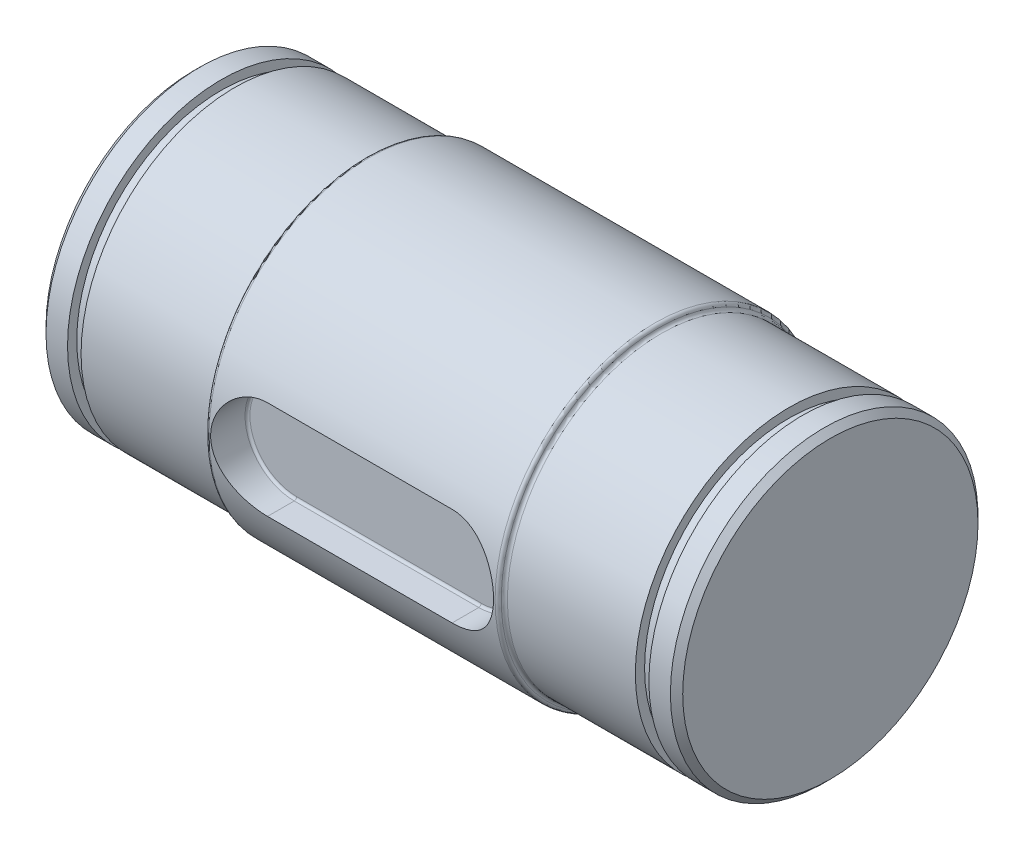
ISO-10303-21;
HEADER;
FILE_DESCRIPTION(('STEP AP214'),'2;1');
FILE_NAME('part.step','',(''),(''),'','','');
FILE_SCHEMA(('AUTOMOTIVE_DESIGN { 1 0 10303 214 1 1 1 1 }'));
ENDSEC;
DATA;
#1=APPLICATION_CONTEXT('core data for automotive mechanical design processes');
#2=APPLICATION_PROTOCOL_DEFINITION('international standard','automotive_design',2000,#1);
#3=PRODUCT_CONTEXT('',#1,'mechanical');
#4=PRODUCT('Part','Part','',(#3));
#5=PRODUCT_RELATED_PRODUCT_CATEGORY('part','',(#4));
#6=PRODUCT_DEFINITION_FORMATION('','',#4);
#7=PRODUCT_DEFINITION_CONTEXT('part definition',#1,'design');
#8=PRODUCT_DEFINITION('design','',#6,#7);
#9=PRODUCT_DEFINITION_SHAPE('','',#8);
#10=(LENGTH_UNIT() NAMED_UNIT(*) SI_UNIT(.MILLI.,.METRE.));
#11=(NAMED_UNIT(*) PLANE_ANGLE_UNIT() SI_UNIT($,.RADIAN.));
#12=(NAMED_UNIT(*) SI_UNIT($,.STERADIAN.) SOLID_ANGLE_UNIT());
#13=UNCERTAINTY_MEASURE_WITH_UNIT(LENGTH_MEASURE(1.E-05),#10,'distance_accuracy_value','');
#14=(GEOMETRIC_REPRESENTATION_CONTEXT(3) GLOBAL_UNCERTAINTY_ASSIGNED_CONTEXT((#13)) GLOBAL_UNIT_ASSIGNED_CONTEXT((#10,
#11,#12)) REPRESENTATION_CONTEXT('',''));
#15=CARTESIAN_POINT('',(0.,0.,0.));
#16=DIRECTION('',(0.,0.,1.));
#17=DIRECTION('',(1.,0.,0.));
#18=AXIS2_PLACEMENT_3D('',#15,#16,#17);
#19=CARTESIAN_POINT('',(51.75,0.,0.));
#20=DIRECTION('',(-1.,0.,0.));
#21=DIRECTION('',(0.,0.,1.));
#22=AXIS2_PLACEMENT_3D('',#19,#20,#21);
#23=PLANE('',#22);
#24=CARTESIAN_POINT('',(51.75,0.,0.));
#25=DIRECTION('',(-1.,0.,0.));
#26=DIRECTION('',(0.,0.,1.));
#27=AXIS2_PLACEMENT_3D('',#24,#25,#26);
#28=CIRCLE('',#27,24.000008612981);
#29=CARTESIAN_POINT('',(51.75,0.,24.000008612981));
#30=VERTEX_POINT('',#29);
#31=EDGE_CURVE('E20',#30,#30,#28,.T.);
#32=ORIENTED_EDGE('',*,*,#31,.F.);
#33=EDGE_LOOP('',(#32));
#34=FACE_BOUND('',#33,.T.);
#35=ADVANCED_FACE('F17',(#34),#23,.F.);
#36=CARTESIAN_POINT('',(-51.75,0.,0.));
#37=DIRECTION('',(-1.,0.,0.));
#38=DIRECTION('',(0.,0.,1.));
#39=AXIS2_PLACEMENT_3D('',#36,#37,#38);
#40=PLANE('',#39);
#41=CARTESIAN_POINT('',(-51.75,0.,1.20553902987361E-13));
#42=DIRECTION('',(-1.,0.,0.));
#43=DIRECTION('',(0.,0.,1.));
#44=AXIS2_PLACEMENT_3D('',#41,#42,#43);
#45=CIRCLE('',#44,24.0000096194053);
#46=CARTESIAN_POINT('',(-51.75,0.,24.0000096194054));
#47=VERTEX_POINT('',#46);
#48=EDGE_CURVE('E185',#47,#47,#45,.F.);
#49=ORIENTED_EDGE('',*,*,#48,.F.);
#50=EDGE_LOOP('',(#49));
#51=FACE_BOUND('',#50,.T.);
#52=ADVANCED_FACE('F422',(#51),#40,.T.);
#53=CARTESIAN_POINT('',(50.7500044859261,0.,0.));
#54=DIRECTION('',(-1.,0.,0.));
#55=DIRECTION('',(0.,0.,1.));
#56=AXIS2_PLACEMENT_3D('',#53,#54,#55);
#57=CONICAL_SURFACE('',#56,25.0000044859245,0.785398342833002);
#58=ORIENTED_EDGE('',*,*,#31,.T.);
#59=EDGE_LOOP('',(#58));
#60=FACE_BOUND('',#59,.T.);
#61=CARTESIAN_POINT('',(50.7500044865,0.,0.));
#62=DIRECTION('',(-1.,0.,0.));
#63=DIRECTION('',(0.,0.,1.));
#64=AXIS2_PLACEMENT_3D('',#61,#62,#63);
#65=CIRCLE('',#64,25.);
#66=CARTESIAN_POINT('',(50.7500044865,0.,25.));
#67=VERTEX_POINT('',#66);
#68=EDGE_CURVE('E181',#67,#67,#65,.T.);
#69=ORIENTED_EDGE('',*,*,#68,.F.);
#70=EDGE_LOOP('',(#69));
#71=FACE_BOUND('',#70,.T.);
#72=ADVANCED_FACE('F414',(#60,#71),#57,.T.);
#73=CARTESIAN_POINT('',(-50.7500050101063,0.,1.20301066671185E-13));
#74=DIRECTION('',(1.,0.,0.));
#75=DIRECTION('',(0.,0.,-1.));
#76=AXIS2_PLACEMENT_3D('',#73,#74,#75);
#77=CONICAL_SURFACE('',#76,25.0000050101042,0.785398363801);
#78=CARTESIAN_POINT('',(-50.7500100202085,0.,1.20301065975894E-13));
#79=DIRECTION('',(1.,0.,0.));
#80=DIRECTION('',(0.,0.,-1.));
#81=AXIS2_PLACEMENT_3D('',#78,#79,#80);
#82=CIRCLE('',#81,25.);
#83=CARTESIAN_POINT('',(-50.7500100202085,0.,-24.9999999999999));
#84=VERTEX_POINT('',#83);
#85=EDGE_CURVE('E184',#84,#84,#82,.T.);
#86=ORIENTED_EDGE('',*,*,#85,.F.);
#87=EDGE_LOOP('',(#86));
#88=FACE_BOUND('',#87,.T.);
#89=ORIENTED_EDGE('',*,*,#48,.T.);
#90=EDGE_LOOP('',(#89));
#91=FACE_BOUND('',#90,.T.);
#92=ADVANCED_FACE('F406',(#88,#91),#77,.T.);
#93=CARTESIAN_POINT('',(56.925,0.,0.));
#94=DIRECTION('',(-1.,0.,0.));
#95=DIRECTION('',(0.,0.,1.));
#96=AXIS2_PLACEMENT_3D('',#93,#94,#95);
#97=CYLINDRICAL_SURFACE('',#96,25.);
#98=CARTESIAN_POINT('',(47.25,0.,0.));
#99=DIRECTION('',(-1.,0.,0.));
#100=DIRECTION('',(0.,0.,1.));
#101=AXIS2_PLACEMENT_3D('',#98,#99,#100);
#102=CIRCLE('',#101,25.);
#103=CARTESIAN_POINT('',(47.25,0.,25.));
#104=VERTEX_POINT('',#103);
#105=EDGE_CURVE('E519',#104,#104,#102,.T.);
#106=ORIENTED_EDGE('',*,*,#105,.F.);
#107=EDGE_LOOP('',(#106));
#108=FACE_BOUND('',#107,.T.);
#109=ORIENTED_EDGE('',*,*,#68,.T.);
#110=EDGE_LOOP('',(#109));
#111=FACE_BOUND('',#110,.T.);
#112=ADVANCED_FACE('F398',(#108,#111),#97,.T.);
#113=CARTESIAN_POINT('',(56.925,0.,0.));
#114=DIRECTION('',(-1.,0.,0.));
#115=DIRECTION('',(0.,0.,1.));
#116=AXIS2_PLACEMENT_3D('',#113,#114,#115);
#117=CYLINDRICAL_SURFACE('',#116,25.);
#118=CARTESIAN_POINT('',(-47.25,0.,0.));
#119=DIRECTION('',(-1.,0.,0.));
#120=DIRECTION('',(0.,0.,1.));
#121=AXIS2_PLACEMENT_3D('',#118,#119,#120);
#122=CIRCLE('',#121,25.);
#123=CARTESIAN_POINT('',(-47.25,0.,25.));
#124=VERTEX_POINT('',#123);
#125=EDGE_CURVE('E522',#124,#124,#122,.T.);
#126=ORIENTED_EDGE('',*,*,#125,.T.);
#127=EDGE_LOOP('',(#126));
#128=FACE_BOUND('',#127,.T.);
#129=ORIENTED_EDGE('',*,*,#85,.T.);
#130=EDGE_LOOP('',(#129));
#131=FACE_BOUND('',#130,.T.);
#132=ADVANCED_FACE('F390',(#128,#131),#117,.T.);
#133=CARTESIAN_POINT('',(47.25,0.,0.));
#134=DIRECTION('',(-1.,0.,0.));
#135=DIRECTION('',(0.,0.,1.));
#136=AXIS2_PLACEMENT_3D('',#133,#134,#135);
#137=PLANE('',#136);
#138=CARTESIAN_POINT('',(47.25,0.,0.));
#139=DIRECTION('',(-1.,0.,0.));
#140=DIRECTION('',(0.,0.,1.));
#141=AXIS2_PLACEMENT_3D('',#138,#139,#140);
#142=CIRCLE('',#141,23.5);
#143=CARTESIAN_POINT('',(47.25,0.,23.5));
#144=VERTEX_POINT('',#143);
#145=EDGE_CURVE('E525',#144,#144,#142,.T.);
#146=ORIENTED_EDGE('',*,*,#145,.F.);
#147=EDGE_LOOP('',(#146));
#148=FACE_BOUND('',#147,.T.);
#149=ORIENTED_EDGE('',*,*,#105,.T.);
#150=EDGE_LOOP('',(#149));
#151=FACE_BOUND('',#150,.T.);
#152=ADVANCED_FACE('F382',(#148,#151),#137,.T.);
#153=CARTESIAN_POINT('',(-47.25,0.,0.));
#154=DIRECTION('',(-1.,0.,0.));
#155=DIRECTION('',(0.,0.,1.));
#156=AXIS2_PLACEMENT_3D('',#153,#154,#155);
#157=PLANE('',#156);
#158=CARTESIAN_POINT('',(-47.25,0.,0.));
#159=DIRECTION('',(-1.,0.,0.));
#160=DIRECTION('',(0.,0.,1.));
#161=AXIS2_PLACEMENT_3D('',#158,#159,#160);
#162=CIRCLE('',#161,23.5);
#163=CARTESIAN_POINT('',(-47.25,0.,23.5));
#164=VERTEX_POINT('',#163);
#165=EDGE_CURVE('E528',#164,#164,#162,.F.);
#166=ORIENTED_EDGE('',*,*,#165,.F.);
#167=EDGE_LOOP('',(#166));
#168=FACE_BOUND('',#167,.T.);
#169=ORIENTED_EDGE('',*,*,#125,.F.);
#170=EDGE_LOOP('',(#169));
#171=FACE_BOUND('',#170,.T.);
#172=ADVANCED_FACE('F374',(#168,#171),#157,.F.);
#173=CARTESIAN_POINT('',(56.925,0.,0.));
#174=DIRECTION('',(-1.,0.,0.));
#175=DIRECTION('',(0.,0.,1.));
#176=AXIS2_PLACEMENT_3D('',#173,#174,#175);
#177=CYLINDRICAL_SURFACE('',#176,23.5);
#178=CARTESIAN_POINT('',(45.05,0.,0.));
#179=DIRECTION('',(-1.,0.,0.));
#180=DIRECTION('',(0.,0.,1.));
#181=AXIS2_PLACEMENT_3D('',#178,#179,#180);
#182=CIRCLE('',#181,23.5);
#183=CARTESIAN_POINT('',(45.05,0.,23.5));
#184=VERTEX_POINT('',#183);
#185=EDGE_CURVE('E531',#184,#184,#182,.F.);
#186=ORIENTED_EDGE('',*,*,#185,.T.);
#187=EDGE_LOOP('',(#186));
#188=FACE_BOUND('',#187,.T.);
#189=ORIENTED_EDGE('',*,*,#145,.T.);
#190=EDGE_LOOP('',(#189));
#191=FACE_BOUND('',#190,.T.);
#192=ADVANCED_FACE('F366',(#188,#191),#177,.T.);
#193=CARTESIAN_POINT('',(56.925,0.,0.));
#194=DIRECTION('',(-1.,0.,0.));
#195=DIRECTION('',(0.,0.,1.));
#196=AXIS2_PLACEMENT_3D('',#193,#194,#195);
#197=CYLINDRICAL_SURFACE('',#196,23.5);
#198=ORIENTED_EDGE('',*,*,#165,.T.);
#199=EDGE_LOOP('',(#198));
#200=FACE_BOUND('',#199,.T.);
#201=CARTESIAN_POINT('',(-45.05,0.,0.));
#202=DIRECTION('',(-1.,0.,0.));
#203=DIRECTION('',(0.,0.,1.));
#204=AXIS2_PLACEMENT_3D('',#201,#202,#203);
#205=CIRCLE('',#204,23.5);
#206=CARTESIAN_POINT('',(-45.05,0.,23.5));
#207=VERTEX_POINT('',#206);
#208=EDGE_CURVE('E534',#207,#207,#205,.F.);
#209=ORIENTED_EDGE('',*,*,#208,.F.);
#210=EDGE_LOOP('',(#209));
#211=FACE_BOUND('',#210,.T.);
#212=ADVANCED_FACE('F358',(#200,#211),#197,.T.);
#213=CARTESIAN_POINT('',(45.05,0.,0.));
#214=DIRECTION('',(-1.,0.,0.));
#215=DIRECTION('',(0.,0.,1.));
#216=AXIS2_PLACEMENT_3D('',#213,#214,#215);
#217=PLANE('',#216);
#218=ORIENTED_EDGE('',*,*,#185,.F.);
#219=EDGE_LOOP('',(#218));
#220=FACE_BOUND('',#219,.T.);
#221=CARTESIAN_POINT('',(45.05,0.,0.));
#222=DIRECTION('',(-1.,0.,0.));
#223=DIRECTION('',(0.,0.,1.));
#224=AXIS2_PLACEMENT_3D('',#221,#222,#223);
#225=CIRCLE('',#224,25.);
#226=CARTESIAN_POINT('',(45.05,0.,25.));
#227=VERTEX_POINT('',#226);
#228=EDGE_CURVE('E89',#227,#227,#225,.T.);
#229=ORIENTED_EDGE('',*,*,#228,.F.);
#230=EDGE_LOOP('',(#229));
#231=FACE_BOUND('',#230,.T.);
#232=ADVANCED_FACE('F350',(#220,#231),#217,.F.);
#233=CARTESIAN_POINT('',(-45.05,0.,0.));
#234=DIRECTION('',(-1.,0.,0.));
#235=DIRECTION('',(0.,0.,1.));
#236=AXIS2_PLACEMENT_3D('',#233,#234,#235);
#237=PLANE('',#236);
#238=ORIENTED_EDGE('',*,*,#208,.T.);
#239=EDGE_LOOP('',(#238));
#240=FACE_BOUND('',#239,.T.);
#241=CARTESIAN_POINT('',(-45.05,0.,0.));
#242=DIRECTION('',(-1.,0.,0.));
#243=DIRECTION('',(0.,0.,1.));
#244=AXIS2_PLACEMENT_3D('',#241,#242,#243);
#245=CIRCLE('',#244,25.);
#246=CARTESIAN_POINT('',(-45.05,0.,25.));
#247=VERTEX_POINT('',#246);
#248=EDGE_CURVE('E88',#247,#247,#245,.F.);
#249=ORIENTED_EDGE('',*,*,#248,.F.);
#250=EDGE_LOOP('',(#249));
#251=FACE_BOUND('',#250,.T.);
#252=ADVANCED_FACE('F342',(#240,#251),#237,.T.);
#253=CARTESIAN_POINT('',(56.925,0.,0.));
#254=DIRECTION('',(-1.,0.,0.));
#255=DIRECTION('',(0.,0.,1.));
#256=AXIS2_PLACEMENT_3D('',#253,#254,#255);
#257=CYLINDRICAL_SURFACE('',#256,25.);
#258=ORIENTED_EDGE('',*,*,#228,.T.);
#259=EDGE_LOOP('',(#258));
#260=FACE_BOUND('',#259,.T.);
#261=CARTESIAN_POINT('',(24.25,0.,0.));
#262=DIRECTION('',(-1.,0.,0.));
#263=DIRECTION('',(0.,1.,-5.23143334208E-12));
#264=AXIS2_PLACEMENT_3D('',#261,#262,#263);
#265=CIRCLE('',#264,25.);
#266=CARTESIAN_POINT('',(24.25,25.,-1.30776526629399E-10));
#267=VERTEX_POINT('',#266);
#268=EDGE_CURVE('E178',#267,#267,#265,.F.);
#269=ORIENTED_EDGE('',*,*,#268,.T.);
#270=EDGE_LOOP('',(#269));
#271=FACE_BOUND('',#270,.T.);
#272=ADVANCED_FACE('F336',(#260,#271),#257,.T.);
#273=CARTESIAN_POINT('',(0.,0.,20.));
#274=DIRECTION('',(0.,0.,1.));
#275=DIRECTION('',(1.,0.,0.));
#276=AXIS2_PLACEMENT_3D('',#273,#274,#275);
#277=PLANE('',#276);
#278=DIRECTION('',(1.,0.,0.));
#279=VECTOR('',#278,1.);
#280=CARTESIAN_POINT('',(-15.2773739955,7.6,20.));
#281=LINE('',#280,#279);
#282=CARTESIAN_POINT('',(15.,7.6,20.));
#283=VERTEX_POINT('',#282);
#284=CARTESIAN_POINT('',(-15.,7.6,20.));
#285=VERTEX_POINT('',#284);
#286=EDGE_CURVE('E77',#283,#285,#281,.F.);
#287=ORIENTED_EDGE('',*,*,#286,.T.);
#288=CARTESIAN_POINT('',(-15.,0.,20.));
#289=DIRECTION('',(0.,0.,-1.));
#290=DIRECTION('',(0.,-1.,0.));
#291=AXIS2_PLACEMENT_3D('',#288,#289,#290);
#292=CIRCLE('',#291,7.6);
#293=CARTESIAN_POINT('',(-15.,-7.6,20.));
#294=VERTEX_POINT('',#293);
#295=EDGE_CURVE('E81',#285,#294,#292,.F.);
#296=ORIENTED_EDGE('',*,*,#295,.T.);
#297=DIRECTION('',(-1.,0.,0.));
#298=VECTOR('',#297,1.);
#299=CARTESIAN_POINT('',(15.2773739955,-7.6,20.));
#300=LINE('',#299,#298);
#301=CARTESIAN_POINT('',(15.,-7.6,20.));
#302=VERTEX_POINT('',#301);
#303=EDGE_CURVE('E144',#294,#302,#300,.F.);
#304=ORIENTED_EDGE('',*,*,#303,.T.);
#305=CARTESIAN_POINT('',(15.,0.,20.));
#306=DIRECTION('',(0.,0.,-1.));
#307=DIRECTION('',(0.,1.,0.));
#308=AXIS2_PLACEMENT_3D('',#305,#306,#307);
#309=CIRCLE('',#308,7.6);
#310=EDGE_CURVE('E84',#302,#283,#309,.F.);
#311=ORIENTED_EDGE('',*,*,#310,.T.);
#312=EDGE_LOOP('',(#287,#296,#304,#311));
#313=FACE_BOUND('',#312,.T.);
#314=ADVANCED_FACE('F79',(#313),#277,.T.);
#315=CARTESIAN_POINT('',(-15.2773739955,7.6,20.4));
#316=DIRECTION('',(1.,0.,0.));
#317=DIRECTION('',(0.,0.,-1.));
#318=AXIS2_PLACEMENT_3D('',#315,#316,#317);
#319=CYLINDRICAL_SURFACE('',#318,0.4);
#320=DIRECTION('',(1.,0.,0.));
#321=VECTOR('',#320,1.);
#322=CARTESIAN_POINT('',(15.,8.,20.4));
#323=LINE('',#322,#321);
#324=CARTESIAN_POINT('',(15.,8.,20.4));
#325=VERTEX_POINT('',#324);
#326=CARTESIAN_POINT('',(-15.,8.,20.4));
#327=VERTEX_POINT('',#326);
#328=EDGE_CURVE('E95',#325,#327,#323,.F.);
#329=ORIENTED_EDGE('',*,*,#328,.T.);
#330=CARTESIAN_POINT('',(-15.,7.6,20.4));
#331=DIRECTION('',(-1.,0.,0.));
#332=DIRECTION('',(0.,1.,0.));
#333=AXIS2_PLACEMENT_3D('',#330,#331,#332);
#334=CIRCLE('',#333,0.4);
#335=EDGE_CURVE('E92',#327,#285,#334,.T.);
#336=ORIENTED_EDGE('',*,*,#335,.T.);
#337=ORIENTED_EDGE('',*,*,#286,.F.);
#338=CARTESIAN_POINT('',(15.,7.6,20.4));
#339=DIRECTION('',(-1.,0.,0.));
#340=DIRECTION('',(0.,1.,0.));
#341=AXIS2_PLACEMENT_3D('',#338,#339,#340);
#342=CIRCLE('',#341,0.4);
#343=EDGE_CURVE('E149',#283,#325,#342,.F.);
#344=ORIENTED_EDGE('',*,*,#343,.T.);
#345=EDGE_LOOP('',(#329,#336,#337,#344));
#346=FACE_BOUND('',#345,.T.);
#347=ADVANCED_FACE('F93',(#346),#319,.F.);
#348=CARTESIAN_POINT('',(56.925,0.,0.));
#349=DIRECTION('',(-1.,0.,0.));
#350=DIRECTION('',(0.,0.,1.));
#351=AXIS2_PLACEMENT_3D('',#348,#349,#350);
#352=CYLINDRICAL_SURFACE('',#351,25.);
#353=ORIENTED_EDGE('',*,*,#248,.T.);
#354=EDGE_LOOP('',(#353));
#355=FACE_BOUND('',#354,.T.);
#356=CARTESIAN_POINT('',(-24.25,0.,0.));
#357=DIRECTION('',(-1.,0.,0.));
#358=DIRECTION('',(0.,1.,9.13429921978E-13));
#359=AXIS2_PLACEMENT_3D('',#356,#357,#358);
#360=CIRCLE('',#359,25.);
#361=CARTESIAN_POINT('',(-24.25,25.,2.28391156312348E-11));
#362=VERTEX_POINT('',#361);
#363=EDGE_CURVE('E175',#362,#362,#360,.T.);
#364=ORIENTED_EDGE('',*,*,#363,.T.);
#365=EDGE_LOOP('',(#364));
#366=FACE_BOUND('',#365,.T.);
#367=ADVANCED_FACE('F317',(#355,#366),#352,.T.);
#368=CARTESIAN_POINT('',(24.25,0.,0.));
#369=DIRECTION('',(-1.,0.,0.));
#370=DIRECTION('',(0.,1.,-5.23143334208E-12));
#371=AXIS2_PLACEMENT_3D('',#368,#369,#370);
#372=TOROIDAL_SURFACE('',#371,25.5,0.5);
#373=ORIENTED_EDGE('',*,*,#268,.F.);
#374=EDGE_LOOP('',(#373));
#375=FACE_BOUND('',#374,.T.);
#376=CARTESIAN_POINT('',(23.75,0.,0.));
#377=DIRECTION('',(-1.,0.,0.));
#378=DIRECTION('',(0.,1.,-1.54597272484E-11));
#379=AXIS2_PLACEMENT_3D('',#376,#377,#378);
#380=CIRCLE('',#379,25.5);
#381=CARTESIAN_POINT('',(23.75,25.5,-3.94213799141917E-10));
#382=VERTEX_POINT('',#381);
#383=EDGE_CURVE('E140',#382,#382,#380,.T.);
#384=ORIENTED_EDGE('',*,*,#383,.F.);
#385=EDGE_LOOP('',(#384));
#386=FACE_BOUND('',#385,.T.);
#387=ADVANCED_FACE('F155',(#375,#386),#372,.F.);
#388=CARTESIAN_POINT('',(15.,0.,20.4));
#389=DIRECTION('',(0.,0.,1.));
#390=DIRECTION('',(-1.,-1.01712284428E-10,0.));
#391=AXIS2_PLACEMENT_3D('',#388,#389,#390);
#392=TOROIDAL_SURFACE('',#391,7.6,0.4);
#393=CARTESIAN_POINT('',(15.,0.,20.4));
#394=DIRECTION('',(0.,0.,1.));
#395=DIRECTION('',(1.,0.,0.));
#396=AXIS2_PLACEMENT_3D('',#393,#394,#395);
#397=CIRCLE('',#396,8.);
#398=CARTESIAN_POINT('',(15.,-8.,20.4));
#399=VERTEX_POINT('',#398);
#400=EDGE_CURVE('E136',#399,#325,#397,.T.);
#401=ORIENTED_EDGE('',*,*,#400,.T.);
#402=ORIENTED_EDGE('',*,*,#343,.F.);
#403=ORIENTED_EDGE('',*,*,#310,.F.);
#404=CARTESIAN_POINT('',(15.,-7.6,20.4));
#405=DIRECTION('',(-1.,0.,0.));
#406=DIRECTION('',(0.,0.,1.));
#407=AXIS2_PLACEMENT_3D('',#404,#405,#406);
#408=CIRCLE('',#407,0.4);
#409=EDGE_CURVE('E101',#302,#399,#408,.T.);
#410=ORIENTED_EDGE('',*,*,#409,.T.);
#411=EDGE_LOOP('',(#401,#402,#403,#410));
#412=FACE_BOUND('',#411,.T.);
#413=ADVANCED_FACE('F151',(#412),#392,.F.);
#414=CARTESIAN_POINT('',(15.2773739955,-7.6,20.4));
#415=DIRECTION('',(-1.,0.,0.));
#416=DIRECTION('',(0.,0.,1.));
#417=AXIS2_PLACEMENT_3D('',#414,#415,#416);
#418=CYLINDRICAL_SURFACE('',#417,0.4);
#419=DIRECTION('',(1.,0.,0.));
#420=VECTOR('',#419,1.);
#421=CARTESIAN_POINT('',(-15.,-8.,20.4));
#422=LINE('',#421,#420);
#423=CARTESIAN_POINT('',(-15.,-8.,20.4));
#424=VERTEX_POINT('',#423);
#425=EDGE_CURVE('E225',#424,#399,#422,.T.);
#426=ORIENTED_EDGE('',*,*,#425,.T.);
#427=ORIENTED_EDGE('',*,*,#409,.F.);
#428=ORIENTED_EDGE('',*,*,#303,.F.);
#429=CARTESIAN_POINT('',(-15.,-7.6,20.4));
#430=DIRECTION('',(1.,0.,0.));
#431=DIRECTION('',(0.,-1.,0.));
#432=AXIS2_PLACEMENT_3D('',#429,#430,#431);
#433=CIRCLE('',#432,0.4);
#434=EDGE_CURVE('E56',#294,#424,#433,.F.);
#435=ORIENTED_EDGE('',*,*,#434,.T.);
#436=EDGE_LOOP('',(#426,#427,#428,#435));
#437=FACE_BOUND('',#436,.T.);
#438=ADVANCED_FACE('F123',(#437),#418,.F.);
#439=CARTESIAN_POINT('',(-15.,0.,20.4));
#440=DIRECTION('',(0.,0.,1.));
#441=DIRECTION('',(1.,1.01712520351E-10,0.));
#442=AXIS2_PLACEMENT_3D('',#439,#440,#441);
#443=TOROIDAL_SURFACE('',#442,7.6,0.4);
#444=CARTESIAN_POINT('',(-15.,0.,20.4));
#445=DIRECTION('',(0.,0.,1.));
#446=DIRECTION('',(1.,0.,0.));
#447=AXIS2_PLACEMENT_3D('',#444,#445,#446);
#448=CIRCLE('',#447,8.);
#449=EDGE_CURVE('E220',#327,#424,#448,.T.);
#450=ORIENTED_EDGE('',*,*,#449,.T.);
#451=ORIENTED_EDGE('',*,*,#434,.F.);
#452=ORIENTED_EDGE('',*,*,#295,.F.);
#453=ORIENTED_EDGE('',*,*,#335,.F.);
#454=EDGE_LOOP('',(#450,#451,#452,#453));
#455=FACE_BOUND('',#454,.T.);
#456=ADVANCED_FACE('F100',(#455),#443,.F.);
#457=CARTESIAN_POINT('',(15.,8.,26.));
#458=DIRECTION('',(0.,1.,0.));
#459=DIRECTION('',(0.,0.,1.));
#460=AXIS2_PLACEMENT_3D('',#457,#458,#459);
#461=PLANE('',#460);
#462=DIRECTION('',(-1.,0.,0.));
#463=VECTOR('',#462,1.);
#464=CARTESIAN_POINT('',(56.925,8.00000000000175,24.7386337537054));
#465=LINE('',#464,#463);
#466=CARTESIAN_POINT('',(-15.,8.00000000000087,24.7386337537057));
#467=VERTEX_POINT('',#466);
#468=CARTESIAN_POINT('',(15.,8.00000000000087,24.7386337537057));
#469=VERTEX_POINT('',#468);
#470=EDGE_CURVE('E174',#467,#469,#465,.F.);
#471=ORIENTED_EDGE('',*,*,#470,.F.);
#472=DIRECTION('',(0.,0.,1.));
#473=VECTOR('',#472,1.);
#474=CARTESIAN_POINT('',(-15.,8.,26.));
#475=LINE('',#474,#473);
#476=EDGE_CURVE('E171',#467,#327,#475,.F.);
#477=ORIENTED_EDGE('',*,*,#476,.T.);
#478=ORIENTED_EDGE('',*,*,#328,.F.);
#479=DIRECTION('',(0.,0.,1.));
#480=VECTOR('',#479,1.);
#481=CARTESIAN_POINT('',(15.,8.,26.));
#482=LINE('',#481,#480);
#483=EDGE_CURVE('E139',#325,#469,#482,.T.);
#484=ORIENTED_EDGE('',*,*,#483,.T.);
#485=EDGE_LOOP('',(#471,#477,#478,#484));
#486=FACE_BOUND('',#485,.T.);
#487=ADVANCED_FACE('F122',(#486),#461,.F.);
#488=CARTESIAN_POINT('',(-24.25,0.,0.));
#489=DIRECTION('',(-1.,0.,0.));
#490=DIRECTION('',(0.,1.,9.13429921978E-13));
#491=AXIS2_PLACEMENT_3D('',#488,#489,#490);
#492=TOROIDAL_SURFACE('',#491,25.5,0.5);
#493=ORIENTED_EDGE('',*,*,#363,.F.);
#494=EDGE_LOOP('',(#493));
#495=FACE_BOUND('',#494,.T.);
#496=CARTESIAN_POINT('',(-23.75,0.,0.));
#497=DIRECTION('',(-1.,0.,0.));
#498=DIRECTION('',(0.,1.,-1.28839057478E-11));
#499=AXIS2_PLACEMENT_3D('',#496,#497,#498);
#500=CIRCLE('',#499,25.5);
#501=CARTESIAN_POINT('',(-23.75,25.5,-3.28536167756797E-10));
#502=VERTEX_POINT('',#501);
#503=EDGE_CURVE('E162',#502,#502,#500,.F.);
#504=ORIENTED_EDGE('',*,*,#503,.F.);
#505=EDGE_LOOP('',(#504));
#506=FACE_BOUND('',#505,.T.);
#507=ADVANCED_FACE('F238',(#495,#506),#492,.F.);
#508=CARTESIAN_POINT('',(23.25,0.,0.));
#509=DIRECTION('',(-1.,0.,0.));
#510=DIRECTION('',(0.,1.,-1.54597272484E-11));
#511=AXIS2_PLACEMENT_3D('',#508,#509,#510);
#512=TOROIDAL_SURFACE('',#511,25.5,0.5);
#513=ORIENTED_EDGE('',*,*,#383,.T.);
#514=EDGE_LOOP('',(#513));
#515=FACE_BOUND('',#514,.T.);
#516=CARTESIAN_POINT('',(23.25,0.,0.));
#517=DIRECTION('',(-1.,0.,0.));
#518=DIRECTION('',(0.,0.,1.));
#519=AXIS2_PLACEMENT_3D('',#516,#517,#518);
#520=CIRCLE('',#519,26.);
#521=CARTESIAN_POINT('',(23.25,0.,26.));
#522=VERTEX_POINT('',#521);
#523=EDGE_CURVE('E170',#522,#522,#520,.T.);
#524=ORIENTED_EDGE('',*,*,#523,.F.);
#525=EDGE_LOOP('',(#524));
#526=FACE_BOUND('',#525,.T.);
#527=ADVANCED_FACE('F235',(#515,#526),#512,.T.);
#528=CARTESIAN_POINT('',(15.,0.,26.));
#529=DIRECTION('',(0.,0.,1.));
#530=DIRECTION('',(1.,0.,0.));
#531=AXIS2_PLACEMENT_3D('',#528,#529,#530);
#532=CYLINDRICAL_SURFACE('',#531,8.);
#533=CARTESIAN_POINT('',(15.,8.,24.738633753706));
#534=CARTESIAN_POINT('',(15.2192705588559,8.00003002803162,24.7386012686902));
#535=CARTESIAN_POINT('',(15.4385292011944,7.99098645035781,24.7415479133923));
#536=CARTESIAN_POINT('',(15.8753670754415,7.9549746883724,24.7531621395127));
#537=CARTESIAN_POINT('',(16.0929466893541,7.92801071060019,24.7618283783405));
#538=CARTESIAN_POINT('',(16.5243086661961,7.85647453724807,24.7846147424266));
#539=CARTESIAN_POINT('',(16.7380994947822,7.81194872986761,24.7987204974571));
#540=CARTESIAN_POINT('',(17.1609660171612,7.7056956832938,24.8319425235332));
#541=CARTESIAN_POINT('',(17.3700415773019,7.64396795717979,24.8510589364105));
#542=CARTESIAN_POINT('',(17.7819259738527,7.50387777626658,24.8937173687698));
#543=CARTESIAN_POINT('',(17.9847386151953,7.42552565853958,24.9172566370773));
#544=CARTESIAN_POINT('',(18.3829970861467,7.25275564566746,24.9680924942892));
#545=CARTESIAN_POINT('',(18.5784401491538,7.15833178898069,24.995390476705));
#546=CARTESIAN_POINT('',(18.9607145898912,6.9541146971394,25.0529746731592));
#547=CARTESIAN_POINT('',(19.1475440728055,6.8443181015302,25.0832615401342));
#548=CARTESIAN_POINT('',(19.5114410126458,6.61012270031495,25.1459931100598));
#549=CARTESIAN_POINT('',(19.6885079266419,6.48572308378625,25.1784379328007));
#550=CARTESIAN_POINT('',(20.0369763655414,6.21919710421829,25.2456140569195));
#551=CARTESIAN_POINT('',(20.2080500182667,6.07665181367262,25.2803847217888));
#552=CARTESIAN_POINT('',(20.5376821024352,5.77785117844753,25.3503446706514));
#553=CARTESIAN_POINT('',(20.6962403247892,5.62159560480917,25.3855339616272));
#554=CARTESIAN_POINT('',(20.9998998793105,5.2962935836556,25.4553914397402));
#555=CARTESIAN_POINT('',(21.1449962502721,5.12724246184191,25.4900594308455));
#556=CARTESIAN_POINT('',(21.4207127076744,4.77745129335323,25.5579282045035));
#557=CARTESIAN_POINT('',(21.5513332056527,4.59671157920696,25.5911290287506));
#558=CARTESIAN_POINT('',(21.7999754970546,4.22046376048394,25.6558946570076));
#559=CARTESIAN_POINT('',(21.9176469613182,4.0247146042073,25.6874057186764));
#560=CARTESIAN_POINT('',(22.1359668706181,3.62354913789891,25.7470580360845));
#561=CARTESIAN_POINT('',(22.2366218442432,3.41813657419523,25.7752005829809));
#562=CARTESIAN_POINT('',(22.420055917156,2.99916792684629,25.8273013235358));
#563=CARTESIAN_POINT('',(22.5028503862171,2.78561903261708,25.8512631115037));
#564=CARTESIAN_POINT('',(22.649921354537,2.3518422630008,25.8943308209309));
#565=CARTESIAN_POINT('',(22.7142024835504,2.13161607270256,25.9134379562845));
#566=CARTESIAN_POINT('',(22.8454431758837,1.59741783786105,25.9527560719791));
#567=CARTESIAN_POINT('',(22.903314691152,1.28097205456156,25.9703879749263));
#568=CARTESIAN_POINT('',(22.9805892392786,0.642981149249854,25.9940075673692));
#569=CARTESIAN_POINT('',(22.9999938147905,0.321436232251335,25.999995723818));
#570=CARTESIAN_POINT('',(23.0000042165041,-0.219125510161256,26.0000029151056));
#571=CARTESIAN_POINT('',(22.990993512199,-0.438200511781659,25.9972249702586));
#572=CARTESIAN_POINT('',(22.9550411980609,-0.874802538634958,25.9861956845295));
#573=CARTESIAN_POINT('',(22.9280961769278,-1.09232926141121,25.9779433023514));
#574=CARTESIAN_POINT('',(22.8564928823853,-1.52429991765145,25.9561808535043));
#575=CARTESIAN_POINT('',(22.811824355255,-1.7387419919777,25.9426677433899));
#576=CARTESIAN_POINT('',(22.7051519279833,-2.16298160545598,25.9107463484076));
#577=CARTESIAN_POINT('',(22.6431414905465,-2.37277736085953,25.8923362176617));
#578=CARTESIAN_POINT('',(22.5024729356723,-2.78574605855141,25.8511622754655));
#579=CARTESIAN_POINT('',(22.4238516794593,-2.98893253412193,25.8284081144958));
#580=CARTESIAN_POINT('',(22.2504752944563,-3.38791056183328,25.7791094787746));
#581=CARTESIAN_POINT('',(22.1557141091464,-3.58369930414724,25.7525635817769));
#582=CARTESIAN_POINT('',(21.9508294897242,-3.96649458076771,25.696387547573));
#583=CARTESIAN_POINT('',(21.840712293684,-4.15350464021115,25.6667586640028));
#584=CARTESIAN_POINT('',(21.6058050009658,-4.51777973159953,25.6051520411434));
#585=CARTESIAN_POINT('',(21.4810081783441,-4.69504024145762,25.5731732276961));
#586=CARTESIAN_POINT('',(21.2140598723134,-5.04330052954374,25.506810535743));
#587=CARTESIAN_POINT('',(21.0715321722645,-5.21400410063578,25.4723851217546));
#588=CARTESIAN_POINT('',(20.7728454398206,-5.54288759643121,25.4028473693241));
#589=CARTESIAN_POINT('',(20.6166861545081,-5.70106728866533,25.3677350181461));
#590=CARTESIAN_POINT('',(20.2916530442582,-6.00398016693894,25.2977548558117));
#591=CARTESIAN_POINT('',(20.1227740000993,-6.14870777825165,25.2628871515253));
#592=CARTESIAN_POINT('',(19.7734660827852,-6.42366002689184,25.1943776155279));
#593=CARTESIAN_POINT('',(19.5930415117413,-6.55389001735635,25.1607353344464));
#594=CARTESIAN_POINT('',(19.2171197615747,-6.80204828924933,25.0948008983861));
#595=CARTESIAN_POINT('',(19.021360909541,-6.9195949196792,25.062562350649));
#596=CARTESIAN_POINT('',(18.6201941888317,-7.13766781821739,25.0013304696352));
#597=CARTESIAN_POINT('',(18.4147900283401,-7.23820056005455,24.9723359034637));
#598=CARTESIAN_POINT('',(17.9957675740503,-7.42142942388002,24.9184974100846));
#599=CARTESIAN_POINT('',(17.7821538839746,-7.5041353756095,24.8936511971761));
#600=CARTESIAN_POINT('',(17.3482482024732,-7.65102791649109,24.8488962406672));
#601=CARTESIAN_POINT('',(17.1279579234481,-7.71521921057063,24.8289862428614));
#602=CARTESIAN_POINT('',(16.5942301599398,-7.8460596483451,24.7880189035354));
#603=CARTESIAN_POINT('',(16.2782991052981,-7.90370673421533,24.769601964515));
#604=CARTESIAN_POINT('',(15.8008563566974,-7.96143261955182,24.7510794702751));
#605=CARTESIAN_POINT('',(15.6411049269818,-7.97588379664448,24.7464224496472));
#606=CARTESIAN_POINT('',(15.3209198755068,-7.99516840004497,24.7401968703129));
#607=CARTESIAN_POINT('',(15.1604860825557,-7.9999992503679,24.7386291388106));
#608=CARTESIAN_POINT('',(15.,-8.,24.738633753706));
#609=B_SPLINE_CURVE_WITH_KNOTS('',3,(#533,#534,#535,#536,#537,#538,#539,#540,#541,#542,#543,
#544,#545,#546,#547,#548,#549,#550,#551,#552,#553,#554,#555,#556,#557,#558,#559,#560,#561,#562,
#563,#564,#565,#566,#567,#568,#569,#570,#571,#572,#573,#574,#575,#576,#577,#578,#579,#580,#581,
#582,#583,#584,#585,#586,#587,#588,#589,#590,#591,#592,#593,#594,#595,#596,#597,#598,#599,#600,
#601,#602,#603,#604,#605,#606,#607,#608),.UNSPECIFIED.,.F.,.F.,(4,2,2,2,2,2,2,2,2,2,2,2,2,2,2,2,
2,2,2,2,2,2,2,2,2,2,2,2,2,2,2,2,2,2,2,2,2,4),(0.,0.65758707979216,1.3150198555843,
1.97072758041263,2.62645386770949,3.28177361207427,3.93733696815623,4.59304385367027,
5.24878716858773,5.92414436682801,6.59951284554364,7.27512924276037,7.9507264278169,
8.64155129592295,9.33211051598308,10.0220730867704,10.7118629638922,11.675785987273,
12.6396703533204,13.2967576143527,13.9539698961855,14.6115629559641,15.2694042403123,
15.9258007543949,16.5824441266129,17.2388215234714,17.8955008408859,18.5698251206807,
19.2441619144047,19.9187769280671,20.5931420131763,21.2841043716796,21.9748032272707,
22.6651202497546,23.3552616946565,24.3173998928687,24.7985453681027,25.2798196598466),.UNSPECIFIED.);
#610=CARTESIAN_POINT('',(15.,-8.00000000000088,24.7386337537057));
#611=VERTEX_POINT('',#610);
#612=EDGE_CURVE('E193',#469,#611,#609,.T.);
#613=ORIENTED_EDGE('',*,*,#612,.F.);
#614=ORIENTED_EDGE('',*,*,#483,.F.);
#615=ORIENTED_EDGE('',*,*,#400,.F.);
#616=DIRECTION('',(0.,0.,-1.));
#617=VECTOR('',#616,1.);
#618=CARTESIAN_POINT('',(15.,-8.,26.));
#619=LINE('',#618,#617);
#620=EDGE_CURVE('E223',#399,#611,#619,.F.);
#621=ORIENTED_EDGE('',*,*,#620,.T.);
#622=EDGE_LOOP('',(#613,#614,#615,#621));
#623=FACE_BOUND('',#622,.T.);
#624=ADVANCED_FACE('F237',(#623),#532,.F.);
#625=CARTESIAN_POINT('',(-15.,-8.,26.));
#626=DIRECTION('',(0.,-1.,0.));
#627=DIRECTION('',(0.,0.,-1.));
#628=AXIS2_PLACEMENT_3D('',#625,#626,#627);
#629=PLANE('',#628);
#630=DIRECTION('',(-1.,0.,0.));
#631=VECTOR('',#630,1.);
#632=CARTESIAN_POINT('',(56.925,-8.00000000000176,24.7386337537054));
#633=LINE('',#632,#631);
#634=CARTESIAN_POINT('',(-15.,-8.00000000000044,24.7386337537057));
#635=VERTEX_POINT('',#634);
#636=EDGE_CURVE('E192',#611,#635,#633,.T.);
#637=ORIENTED_EDGE('',*,*,#636,.F.);
#638=ORIENTED_EDGE('',*,*,#620,.F.);
#639=ORIENTED_EDGE('',*,*,#425,.F.);
#640=DIRECTION('',(0.,0.,1.));
#641=VECTOR('',#640,1.);
#642=CARTESIAN_POINT('',(-15.,-8.,26.));
#643=LINE('',#642,#641);
#644=EDGE_CURVE('E35',#424,#635,#643,.T.);
#645=ORIENTED_EDGE('',*,*,#644,.T.);
#646=EDGE_LOOP('',(#637,#638,#639,#645));
#647=FACE_BOUND('',#646,.T.);
#648=ADVANCED_FACE('F257',(#647),#629,.F.);
#649=CARTESIAN_POINT('',(-15.,0.,26.));
#650=DIRECTION('',(0.,0.,1.));
#651=DIRECTION('',(1.,0.,0.));
#652=AXIS2_PLACEMENT_3D('',#649,#650,#651);
#653=CYLINDRICAL_SURFACE('',#652,8.);
#654=ORIENTED_EDGE('',*,*,#476,.F.);
#655=CARTESIAN_POINT('',(-15.,-8.,24.738633753706));
#656=CARTESIAN_POINT('',(-15.2192705588559,-8.00003002803162,24.7386012686902));
#657=CARTESIAN_POINT('',(-15.4385292011944,-7.99098645035781,24.7415479133923));
#658=CARTESIAN_POINT('',(-15.8753670754415,-7.9549746883724,24.7531621395127));
#659=CARTESIAN_POINT('',(-16.0929466893541,-7.92801071060019,24.7618283783405));
#660=CARTESIAN_POINT('',(-16.5243086661961,-7.85647453724807,24.7846147424266));
#661=CARTESIAN_POINT('',(-16.7380994947822,-7.81194872986761,24.7987204974571));
#662=CARTESIAN_POINT('',(-17.1609660171612,-7.7056956832938,24.8319425235332));
#663=CARTESIAN_POINT('',(-17.3700415773019,-7.64396795717979,24.8510589364105));
#664=CARTESIAN_POINT('',(-17.7819259738527,-7.50387777626658,24.8937173687698));
#665=CARTESIAN_POINT('',(-17.9847386151953,-7.42552565853958,24.9172566370773));
#666=CARTESIAN_POINT('',(-18.3829970861467,-7.25275564566746,24.9680924942892));
#667=CARTESIAN_POINT('',(-18.5784401491538,-7.15833178898069,24.995390476705));
#668=CARTESIAN_POINT('',(-18.9607145898912,-6.9541146971394,25.0529746731591));
#669=CARTESIAN_POINT('',(-19.1475440728055,-6.8443181015302,25.0832615401342));
#670=CARTESIAN_POINT('',(-19.5114410126458,-6.61012270031495,25.1459931100598));
#671=CARTESIAN_POINT('',(-19.6885079266419,-6.48572308378625,25.1784379328007));
#672=CARTESIAN_POINT('',(-20.0369763655414,-6.21919710421829,25.2456140569195));
#673=CARTESIAN_POINT('',(-20.2080500182667,-6.07665181367262,25.2803847217888));
#674=CARTESIAN_POINT('',(-20.5376821024352,-5.77785117844753,25.3503446706514));
#675=CARTESIAN_POINT('',(-20.6962403247892,-5.62159560480917,25.3855339616272));
#676=CARTESIAN_POINT('',(-20.9998998793105,-5.2962935836556,25.4553914397402));
#677=CARTESIAN_POINT('',(-21.1449962502721,-5.12724246184192,25.4900594308454));
#678=CARTESIAN_POINT('',(-21.4207127076744,-4.77745129335324,25.5579282045035));
#679=CARTESIAN_POINT('',(-21.5513332056527,-4.59671157920696,25.5911290287506));
#680=CARTESIAN_POINT('',(-21.7999754970546,-4.22046376048394,25.6558946570076));
#681=CARTESIAN_POINT('',(-21.9176469613182,-4.0247146042073,25.6874057186764));
#682=CARTESIAN_POINT('',(-22.1359668706181,-3.62354913789891,25.7470580360845));
#683=CARTESIAN_POINT('',(-22.2366218442432,-3.41813657419523,25.7752005829809));
#684=CARTESIAN_POINT('',(-22.420055917156,-2.99916792684629,25.8273013235358));
#685=CARTESIAN_POINT('',(-22.5028503862171,-2.78561903261708,25.8512631115037));
#686=CARTESIAN_POINT('',(-22.649921354537,-2.3518422630008,25.8943308209309));
#687=CARTESIAN_POINT('',(-22.7142024835504,-2.13161607270256,25.9134379562845));
#688=CARTESIAN_POINT('',(-22.8454431758837,-1.59741783786105,25.9527560719791));
#689=CARTESIAN_POINT('',(-22.903314691152,-1.28097205456157,25.9703879749263));
#690=CARTESIAN_POINT('',(-22.9805892392786,-0.642981149249858,25.9940075673692));
#691=CARTESIAN_POINT('',(-22.9999938147905,-0.32143623225134,25.999995723818));
#692=CARTESIAN_POINT('',(-23.0000042165041,0.21912551016125,26.0000029151056));
#693=CARTESIAN_POINT('',(-22.990993512199,0.438200511781653,25.9972249702586));
#694=CARTESIAN_POINT('',(-22.9550411980609,0.874802538634952,25.9861956845294));
#695=CARTESIAN_POINT('',(-22.9280961769278,1.09232926141121,25.9779433023514));
#696=CARTESIAN_POINT('',(-22.8564928823853,1.52429991765145,25.9561808535043));
#697=CARTESIAN_POINT('',(-22.811824355255,1.7387419919777,25.9426677433899));
#698=CARTESIAN_POINT('',(-22.7051519279833,2.16298160545598,25.9107463484076));
#699=CARTESIAN_POINT('',(-22.6431414905465,2.37277736085952,25.8923362176617));
#700=CARTESIAN_POINT('',(-22.5024729356723,2.7857460585514,25.8511622754655));
#701=CARTESIAN_POINT('',(-22.4238516794593,2.98893253412192,25.8284081144958));
#702=CARTESIAN_POINT('',(-22.2504752944563,3.38791056183327,25.7791094787746));
#703=CARTESIAN_POINT('',(-22.1557141091464,3.58369930414724,25.7525635817769));
#704=CARTESIAN_POINT('',(-21.9508294897242,3.9664945807677,25.696387547573));
#705=CARTESIAN_POINT('',(-21.840712293684,4.15350464021114,25.6667586640028));
#706=CARTESIAN_POINT('',(-21.6058050009658,4.51777973159953,25.6051520411434));
#707=CARTESIAN_POINT('',(-21.4810081783441,4.69504024145762,25.5731732276961));
#708=CARTESIAN_POINT('',(-21.2140598723134,5.04330052954373,25.506810535743));
#709=CARTESIAN_POINT('',(-21.0715321722645,5.21400410063577,25.4723851217545));
#710=CARTESIAN_POINT('',(-20.7728454398206,5.5428875964312,25.4028473693241));
#711=CARTESIAN_POINT('',(-20.6166861545081,5.70106728866532,25.3677350181461));
#712=CARTESIAN_POINT('',(-20.2916530442582,6.00398016693894,25.2977548558117));
#713=CARTESIAN_POINT('',(-20.1227740000993,6.14870777825165,25.2628871515253));
#714=CARTESIAN_POINT('',(-19.7734660827852,6.42366002689183,25.1943776155279));
#715=CARTESIAN_POINT('',(-19.5930415117413,6.55389001735635,25.1607353344464));
#716=CARTESIAN_POINT('',(-19.2171197615747,6.80204828924933,25.0948008983861));
#717=CARTESIAN_POINT('',(-19.021360909541,6.9195949196792,25.062562350649));
#718=CARTESIAN_POINT('',(-18.6201941888317,7.13766781821739,25.0013304696352));
#719=CARTESIAN_POINT('',(-18.4147900283401,7.23820056005455,24.9723359034637));
#720=CARTESIAN_POINT('',(-17.9957675740503,7.42142942388002,24.9184974100846));
#721=CARTESIAN_POINT('',(-17.7821538839746,7.5041353756095,24.8936511971761));
#722=CARTESIAN_POINT('',(-17.3482482024732,7.65102791649108,24.8488962406672));
#723=CARTESIAN_POINT('',(-17.1279579234481,7.71521921057063,24.8289862428614));
#724=CARTESIAN_POINT('',(-16.5942301599398,7.84605964834509,24.7880189035354));
#725=CARTESIAN_POINT('',(-16.2782991052981,7.90370673421533,24.769601964515));
#726=CARTESIAN_POINT('',(-15.8008563566974,7.96143261955182,24.7510794702751));
#727=CARTESIAN_POINT('',(-15.6411049269818,7.97588379664448,24.7464224496472));
#728=CARTESIAN_POINT('',(-15.3209198755068,7.99516840004497,24.7401968703129));
#729=CARTESIAN_POINT('',(-15.1604860825557,7.9999992503679,24.7386291388106));
#730=CARTESIAN_POINT('',(-15.,8.,24.738633753706));
#731=B_SPLINE_CURVE_WITH_KNOTS('',3,(#655,#656,#657,#658,#659,#660,#661,#662,#663,#664,#665,
#666,#667,#668,#669,#670,#671,#672,#673,#674,#675,#676,#677,#678,#679,#680,#681,#682,#683,#684,
#685,#686,#687,#688,#689,#690,#691,#692,#693,#694,#695,#696,#697,#698,#699,#700,#701,#702,#703,
#704,#705,#706,#707,#708,#709,#710,#711,#712,#713,#714,#715,#716,#717,#718,#719,#720,#721,#722,
#723,#724,#725,#726,#727,#728,#729,#730),.UNSPECIFIED.,.F.,.F.,(4,2,2,2,2,2,2,2,2,2,2,2,2,2,2,2,
2,2,2,2,2,2,2,2,2,2,2,2,2,2,2,2,2,2,2,2,2,4),(0.,0.65758707979216,1.3150198555843,
1.97072758041263,2.62645386770949,3.28177361207427,3.93733696815623,4.59304385367027,
5.24878716858773,5.92414436682801,6.59951284554364,7.27512924276036,7.9507264278169,
8.64155129592295,9.33211051598308,10.0220730867704,10.7118629638922,11.675785987273,
12.6396703533204,13.2967576143527,13.9539698961855,14.6115629559641,15.2694042403123,
15.9258007543949,16.5824441266129,17.2388215234714,17.8955008408859,18.5698251206807,
19.2441619144047,19.9187769280671,20.5931420131763,21.2841043716796,21.9748032272707,
22.6651202497546,23.3552616946565,24.3173998928687,24.7985453681027,25.2798196598466),.UNSPECIFIED.);
#732=EDGE_CURVE('E26',#635,#467,#731,.T.);
#733=ORIENTED_EDGE('',*,*,#732,.F.);
#734=ORIENTED_EDGE('',*,*,#644,.F.);
#735=ORIENTED_EDGE('',*,*,#449,.F.);
#736=EDGE_LOOP('',(#654,#733,#734,#735));
#737=FACE_BOUND('',#736,.T.);
#738=ADVANCED_FACE('F199',(#737),#653,.F.);
#739=CARTESIAN_POINT('',(-23.25,0.,0.));
#740=DIRECTION('',(-1.,0.,0.));
#741=DIRECTION('',(0.,1.,-1.28839057478E-11));
#742=AXIS2_PLACEMENT_3D('',#739,#740,#741);
#743=TOROIDAL_SURFACE('',#742,25.5,0.5);
#744=CARTESIAN_POINT('',(-23.25,0.,0.));
#745=DIRECTION('',(-1.,0.,0.));
#746=DIRECTION('',(0.,0.,1.));
#747=AXIS2_PLACEMENT_3D('',#744,#745,#746);
#748=CIRCLE('',#747,26.);
#749=CARTESIAN_POINT('',(-23.25,0.,26.));
#750=VERTEX_POINT('',#749);
#751=EDGE_CURVE('E11',#750,#750,#748,.F.);
#752=ORIENTED_EDGE('',*,*,#751,.F.);
#753=EDGE_LOOP('',(#752));
#754=FACE_BOUND('',#753,.T.);
#755=ORIENTED_EDGE('',*,*,#503,.T.);
#756=EDGE_LOOP('',(#755));
#757=FACE_BOUND('',#756,.T.);
#758=ADVANCED_FACE('F206',(#754,#757),#743,.T.);
#759=CARTESIAN_POINT('',(56.925,0.,0.));
#760=DIRECTION('',(-1.,0.,0.));
#761=DIRECTION('',(0.,0.,1.));
#762=AXIS2_PLACEMENT_3D('',#759,#760,#761);
#763=CYLINDRICAL_SURFACE('',#762,26.);
#764=ORIENTED_EDGE('',*,*,#732,.T.);
#765=ORIENTED_EDGE('',*,*,#470,.T.);
#766=ORIENTED_EDGE('',*,*,#612,.T.);
#767=ORIENTED_EDGE('',*,*,#636,.T.);
#768=EDGE_LOOP('',(#764,#765,#766,#767));
#769=FACE_BOUND('',#768,.T.);
#770=ORIENTED_EDGE('',*,*,#523,.T.);
#771=EDGE_LOOP('',(#770));
#772=FACE_BOUND('',#771,.T.);
#773=ORIENTED_EDGE('',*,*,#751,.T.);
#774=EDGE_LOOP('',(#773));
#775=FACE_BOUND('',#774,.T.);
#776=ADVANCED_FACE('F203',(#769,#772,#775),#763,.T.);
#777=CLOSED_SHELL('',(#35,#52,#72,#92,#112,#132,#152,#172,#192,#212,#232,#252,#272,#314,#347,
#367,#387,#413,#438,#456,#487,#507,#527,#624,#648,#738,#758,#776));
#778=MANIFOLD_SOLID_BREP('B1',#777);
#779=ADVANCED_BREP_SHAPE_REPRESENTATION('',(#18,#778),#14);
#780=SHAPE_DEFINITION_REPRESENTATION(#9,#779);
ENDSEC;
END-ISO-10303-21;
